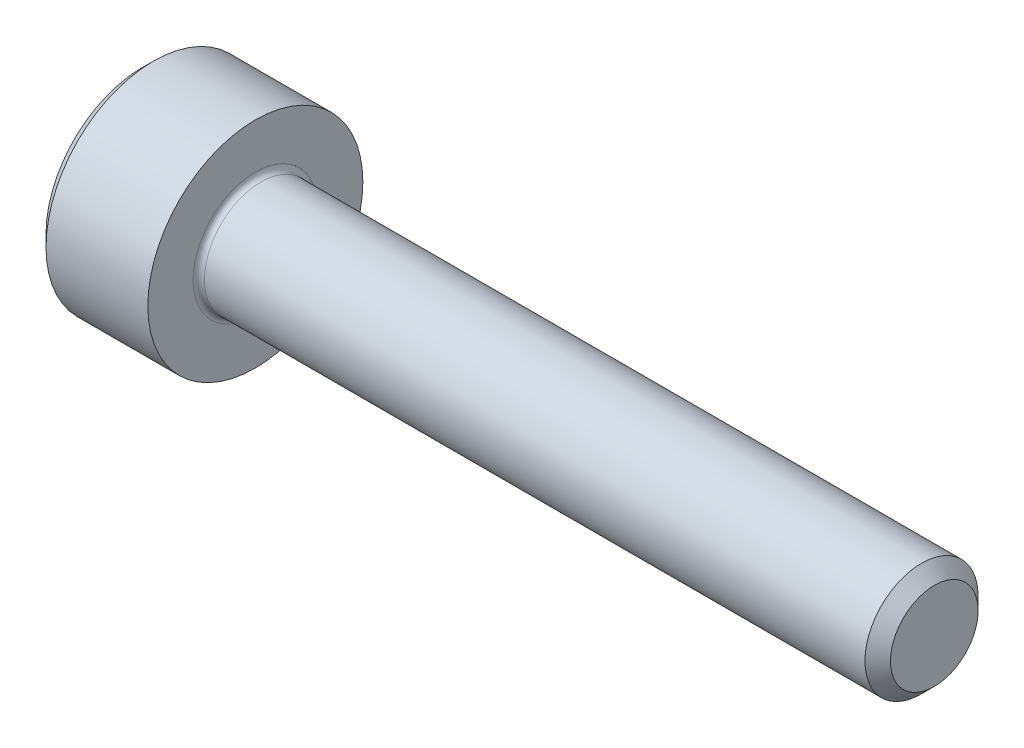
ISO-10303-21;
HEADER;
FILE_DESCRIPTION(('STEP AP214'),'2;1');
FILE_NAME('part.step','',(''),(''),'','','');
FILE_SCHEMA(('AUTOMOTIVE_DESIGN { 1 0 10303 214 1 1 1 1 }'));
ENDSEC;
DATA;
#1=APPLICATION_CONTEXT('core data for automotive mechanical design processes');
#2=APPLICATION_PROTOCOL_DEFINITION('international standard','automotive_design',2000,#1);
#3=PRODUCT_CONTEXT('',#1,'mechanical');
#4=PRODUCT('Part','Part','',(#3));
#5=PRODUCT_RELATED_PRODUCT_CATEGORY('part','',(#4));
#6=PRODUCT_DEFINITION_FORMATION('','',#4);
#7=PRODUCT_DEFINITION_CONTEXT('part definition',#1,'design');
#8=PRODUCT_DEFINITION('design','',#6,#7);
#9=PRODUCT_DEFINITION_SHAPE('','',#8);
#10=(LENGTH_UNIT() NAMED_UNIT(*) SI_UNIT(.MILLI.,.METRE.));
#11=(NAMED_UNIT(*) PLANE_ANGLE_UNIT() SI_UNIT($,.RADIAN.));
#12=(NAMED_UNIT(*) SI_UNIT($,.STERADIAN.) SOLID_ANGLE_UNIT());
#13=UNCERTAINTY_MEASURE_WITH_UNIT(LENGTH_MEASURE(1.E-05),#10,'distance_accuracy_value','');
#14=(GEOMETRIC_REPRESENTATION_CONTEXT(3) GLOBAL_UNCERTAINTY_ASSIGNED_CONTEXT((#13)) GLOBAL_UNIT_ASSIGNED_CONTEXT((#10,
#11,#12)) REPRESENTATION_CONTEXT('',''));
#15=CARTESIAN_POINT('',(0.,0.,0.));
#16=DIRECTION('',(0.,0.,1.));
#17=DIRECTION('',(1.,0.,0.));
#18=AXIS2_PLACEMENT_3D('',#15,#16,#17);
#19=CARTESIAN_POINT('',(0.,0.,0.));
#20=DIRECTION('',(-1.,0.,0.));
#21=DIRECTION('',(0.,0.,1.));
#22=AXIS2_PLACEMENT_3D('',#19,#20,#21);
#23=PLANE('',#22);
#24=DIRECTION('',(0.,-0.499999999999999,0.866025403784439));
#25=VECTOR('',#24,1.);
#26=CARTESIAN_POINT('',(0.,0.892006165897969,0.));
#27=LINE('',#26,#25);
#28=CARTESIAN_POINT('',(0.,0.892006165897969,0.));
#29=VERTEX_POINT('',#28);
#30=CARTESIAN_POINT('',(0.,0.446003082948984,0.772499999999997));
#31=VERTEX_POINT('',#30);
#32=EDGE_CURVE('E260',#29,#31,#27,.T.);
#33=ORIENTED_EDGE('',*,*,#32,.T.);
#34=DIRECTION('',(0.,1.,0.));
#35=VECTOR('',#34,1.);
#36=CARTESIAN_POINT('',(0.,-0.446003082948988,0.772499999999998));
#37=LINE('',#36,#35);
#38=CARTESIAN_POINT('',(0.,-0.446003082948988,0.772499999999998));
#39=VERTEX_POINT('',#38);
#40=EDGE_CURVE('E131',#39,#31,#37,.T.);
#41=ORIENTED_EDGE('',*,*,#40,.F.);
#42=DIRECTION('',(0.,-0.500000000000001,-0.866025403784438));
#43=VECTOR('',#42,1.);
#44=CARTESIAN_POINT('',(0.,-0.446003082948988,0.772499999999998));
#45=LINE('',#44,#43);
#46=CARTESIAN_POINT('',(0.,-0.892006165897975,0.));
#47=VERTEX_POINT('',#46);
#48=EDGE_CURVE('E263',#39,#47,#45,.T.);
#49=ORIENTED_EDGE('',*,*,#48,.T.);
#50=DIRECTION('',(0.,0.499999999999999,-0.866025403784439));
#51=VECTOR('',#50,1.);
#52=CARTESIAN_POINT('',(0.,-0.892006165897975,0.));
#53=LINE('',#52,#51);
#54=CARTESIAN_POINT('',(0.,-0.44600308294899,-0.772500000000002));
#55=VERTEX_POINT('',#54);
#56=EDGE_CURVE('E266',#47,#55,#53,.T.);
#57=ORIENTED_EDGE('',*,*,#56,.T.);
#58=DIRECTION('',(0.,-1.,0.));
#59=VECTOR('',#58,1.);
#60=CARTESIAN_POINT('',(0.,0.446003082948982,-0.772500000000003));
#61=LINE('',#60,#59);
#62=CARTESIAN_POINT('',(0.,0.446003082948982,-0.772500000000003));
#63=VERTEX_POINT('',#62);
#64=EDGE_CURVE('E269',#63,#55,#61,.T.);
#65=ORIENTED_EDGE('',*,*,#64,.F.);
#66=DIRECTION('',(0.,-0.500000000000001,-0.866025403784438));
#67=VECTOR('',#66,1.);
#68=CARTESIAN_POINT('',(0.,0.892006165897969,0.));
#69=LINE('',#68,#67);
#70=EDGE_CURVE('E126',#29,#63,#69,.T.);
#71=ORIENTED_EDGE('',*,*,#70,.F.);
#72=EDGE_LOOP('',(#33,#41,#49,#57,#65,#71));
#73=FACE_BOUND('',#72,.T.);
#74=CARTESIAN_POINT('',(0.,0.,0.));
#75=DIRECTION('',(-1.,0.,0.));
#76=DIRECTION('',(0.,0.,1.));
#77=AXIS2_PLACEMENT_3D('',#74,#75,#76);
#78=CIRCLE('',#77,1.7);
#79=CARTESIAN_POINT('',(0.,0.,1.7));
#80=VERTEX_POINT('',#79);
#81=EDGE_CURVE('E155',#80,#80,#78,.T.);
#82=ORIENTED_EDGE('',*,*,#81,.T.);
#83=EDGE_LOOP('',(#82));
#84=FACE_BOUND('',#83,.T.);
#85=ADVANCED_FACE('F35',(#73,#84),#23,.T.);
#86=CARTESIAN_POINT('',(0.,0.,0.));
#87=DIRECTION('',(1.,0.,0.));
#88=DIRECTION('',(0.,0.,-1.));
#89=AXIS2_PLACEMENT_3D('',#86,#87,#88);
#90=CONICAL_SURFACE('',#89,1.7,0.785398163397449);
#91=CARTESIAN_POINT('',(0.199999999999999,0.,0.));
#92=DIRECTION('',(-1.,0.,0.));
#93=DIRECTION('',(0.,0.,1.));
#94=AXIS2_PLACEMENT_3D('',#91,#92,#93);
#95=CIRCLE('',#94,1.9);
#96=CARTESIAN_POINT('',(0.199999999999999,0.,1.9));
#97=VERTEX_POINT('',#96);
#98=EDGE_CURVE('E152',#97,#97,#95,.T.);
#99=ORIENTED_EDGE('',*,*,#98,.T.);
#100=EDGE_LOOP('',(#99));
#101=FACE_BOUND('',#100,.T.);
#102=ORIENTED_EDGE('',*,*,#81,.F.);
#103=EDGE_LOOP('',(#102));
#104=FACE_BOUND('',#103,.T.);
#105=ADVANCED_FACE('F176',(#101,#104),#90,.T.);
#106=CARTESIAN_POINT('',(-31.75,0.,0.));
#107=DIRECTION('',(-1.,0.,0.));
#108=DIRECTION('',(0.,0.,1.));
#109=AXIS2_PLACEMENT_3D('',#106,#107,#108);
#110=CYLINDRICAL_SURFACE('',#109,1.9);
#111=CARTESIAN_POINT('',(2.,0.,0.));
#112=DIRECTION('',(-1.,0.,0.));
#113=DIRECTION('',(0.,0.,1.));
#114=AXIS2_PLACEMENT_3D('',#111,#112,#113);
#115=CIRCLE('',#114,1.9);
#116=CARTESIAN_POINT('',(2.,0.,1.9));
#117=VERTEX_POINT('',#116);
#118=EDGE_CURVE('E149',#117,#117,#115,.T.);
#119=ORIENTED_EDGE('',*,*,#118,.T.);
#120=EDGE_LOOP('',(#119));
#121=FACE_BOUND('',#120,.T.);
#122=ORIENTED_EDGE('',*,*,#98,.F.);
#123=EDGE_LOOP('',(#122));
#124=FACE_BOUND('',#123,.T.);
#125=ADVANCED_FACE('F181',(#121,#124),#110,.T.);
#126=CARTESIAN_POINT('',(2.,1.9,0.));
#127=DIRECTION('',(1.,0.,0.));
#128=DIRECTION('',(0.,0.,-1.));
#129=AXIS2_PLACEMENT_3D('',#126,#127,#128);
#130=PLANE('',#129);
#131=CARTESIAN_POINT('',(2.,0.,0.));
#132=DIRECTION('',(1.,0.,0.));
#133=DIRECTION('',(0.,0.,-1.));
#134=AXIS2_PLACEMENT_3D('',#131,#132,#133);
#135=CIRCLE('',#134,1.09999999999999);
#136=CARTESIAN_POINT('',(2.,0.,-1.09999999999999));
#137=VERTEX_POINT('',#136);
#138=EDGE_CURVE('E43',#137,#137,#135,.F.);
#139=ORIENTED_EDGE('',*,*,#138,.T.);
#140=EDGE_LOOP('',(#139));
#141=FACE_BOUND('',#140,.T.);
#142=ORIENTED_EDGE('',*,*,#118,.F.);
#143=EDGE_LOOP('',(#142));
#144=FACE_BOUND('',#143,.T.);
#145=ADVANCED_FACE('F160',(#141,#144),#130,.T.);
#146=CARTESIAN_POINT('',(-31.75,0.,0.));
#147=DIRECTION('',(-1.,0.,0.));
#148=DIRECTION('',(0.,0.,1.));
#149=AXIS2_PLACEMENT_3D('',#146,#147,#148);
#150=CYLINDRICAL_SURFACE('',#149,0.999999999999993);
#151=CARTESIAN_POINT('',(2.1,0.,0.));
#152=DIRECTION('',(1.,0.,0.));
#153=DIRECTION('',(0.,0.,-1.));
#154=AXIS2_PLACEMENT_3D('',#151,#152,#153);
#155=CIRCLE('',#154,0.999999999999993);
#156=CARTESIAN_POINT('',(2.1,0.,-0.999999999999993));
#157=VERTEX_POINT('',#156);
#158=EDGE_CURVE('E11',#157,#157,#155,.T.);
#159=ORIENTED_EDGE('',*,*,#158,.T.);
#160=EDGE_LOOP('',(#159));
#161=FACE_BOUND('',#160,.T.);
#162=CARTESIAN_POINT('',(13.774,0.,0.));
#163=DIRECTION('',(-1.,0.,0.));
#164=DIRECTION('',(0.,0.,1.));
#165=AXIS2_PLACEMENT_3D('',#162,#163,#164);
#166=CIRCLE('',#165,0.999999999999985);
#167=CARTESIAN_POINT('',(13.774,0.,0.999999999999985));
#168=VERTEX_POINT('',#167);
#169=EDGE_CURVE('E146',#168,#168,#166,.T.);
#170=ORIENTED_EDGE('',*,*,#169,.T.);
#171=EDGE_LOOP('',(#170));
#172=FACE_BOUND('',#171,.T.);
#173=ADVANCED_FACE('F191',(#161,#172),#150,.T.);
#174=CARTESIAN_POINT('',(14.,0.,0.));
#175=DIRECTION('',(-1.,0.,0.));
#176=DIRECTION('',(0.,0.,1.));
#177=AXIS2_PLACEMENT_3D('',#174,#175,#176);
#178=CONICAL_SURFACE('',#177,0.774,0.785398163397406);
#179=ORIENTED_EDGE('',*,*,#169,.F.);
#180=EDGE_LOOP('',(#179));
#181=FACE_BOUND('',#180,.T.);
#182=CARTESIAN_POINT('',(14.,0.,0.));
#183=DIRECTION('',(-1.,0.,0.));
#184=DIRECTION('',(0.,0.,1.));
#185=AXIS2_PLACEMENT_3D('',#182,#183,#184);
#186=CIRCLE('',#185,0.774);
#187=CARTESIAN_POINT('',(14.,0.,0.774));
#188=VERTEX_POINT('',#187);
#189=EDGE_CURVE('E142',#188,#188,#186,.T.);
#190=ORIENTED_EDGE('',*,*,#189,.T.);
#191=EDGE_LOOP('',(#190));
#192=FACE_BOUND('',#191,.T.);
#193=ADVANCED_FACE('F171',(#181,#192),#178,.T.);
#194=CARTESIAN_POINT('',(14.,0.774,0.));
#195=DIRECTION('',(1.,0.,0.));
#196=DIRECTION('',(0.,0.,-1.));
#197=AXIS2_PLACEMENT_3D('',#194,#195,#196);
#198=PLANE('',#197);
#199=ORIENTED_EDGE('',*,*,#189,.F.);
#200=EDGE_LOOP('',(#199));
#201=FACE_BOUND('',#200,.T.);
#202=ADVANCED_FACE('F164',(#201),#198,.T.);
#203=CARTESIAN_POINT('',(2.1,0.,0.));
#204=DIRECTION('',(1.,0.,0.));
#205=DIRECTION('',(0.,0.,-1.));
#206=AXIS2_PLACEMENT_3D('',#203,#204,#205);
#207=TOROIDAL_SURFACE('',#206,1.09999999999999,0.1);
#208=ORIENTED_EDGE('',*,*,#158,.F.);
#209=EDGE_LOOP('',(#208));
#210=FACE_BOUND('',#209,.T.);
#211=ORIENTED_EDGE('',*,*,#138,.F.);
#212=EDGE_LOOP('',(#211));
#213=FACE_BOUND('',#212,.T.);
#214=ADVANCED_FACE('F37',(#210,#213),#207,.F.);
#215=CARTESIAN_POINT('',(1.,0.892006165897969,0.));
#216=DIRECTION('',(0.,-0.866025403784439,-0.499999999999999));
#217=DIRECTION('',(0.,0.499999999999999,-0.866025403784439));
#218=AXIS2_PLACEMENT_3D('',#215,#216,#217);
#219=PLANE('',#218);
#220=ORIENTED_EDGE('',*,*,#32,.F.);
#221=DIRECTION('',(-1.,0.,0.));
#222=VECTOR('',#221,1.);
#223=CARTESIAN_POINT('',(1.,0.892006165897969,0.));
#224=LINE('',#223,#222);
#225=CARTESIAN_POINT('',(1.,0.892006165897969,0.));
#226=VERTEX_POINT('',#225);
#227=EDGE_CURVE('E250',#226,#29,#224,.T.);
#228=ORIENTED_EDGE('',*,*,#227,.F.);
#229=DIRECTION('',(0.,-0.499999999999999,0.866025403784439));
#230=VECTOR('',#229,1.);
#231=CARTESIAN_POINT('',(1.,0.892006165897969,0.));
#232=LINE('',#231,#230);
#233=CARTESIAN_POINT('',(1.,0.669004624423476,0.386249999999997));
#234=VERTEX_POINT('',#233);
#235=EDGE_CURVE('E118',#226,#234,#232,.T.);
#236=ORIENTED_EDGE('',*,*,#235,.T.);
#237=CARTESIAN_POINT('',(1.,0.446003082948984,0.772499999999997));
#238=VERTEX_POINT('',#237);
#239=EDGE_CURVE('E109',#234,#238,#232,.T.);
#240=ORIENTED_EDGE('',*,*,#239,.T.);
#241=DIRECTION('',(-1.,0.,0.));
#242=VECTOR('',#241,1.);
#243=CARTESIAN_POINT('',(1.,0.446003082948984,0.772499999999997));
#244=LINE('',#243,#242);
#245=EDGE_CURVE('E123',#238,#31,#244,.T.);
#246=ORIENTED_EDGE('',*,*,#245,.T.);
#247=EDGE_LOOP('',(#220,#228,#236,#240,#246));
#248=FACE_BOUND('',#247,.T.);
#249=ADVANCED_FACE('F122',(#248),#219,.T.);
#250=CARTESIAN_POINT('',(1.,-0.446003082948988,0.772499999999998));
#251=DIRECTION('',(0.,0.,1.));
#252=DIRECTION('',(0.,-1.,0.));
#253=AXIS2_PLACEMENT_3D('',#250,#251,#252);
#254=PLANE('',#253);
#255=ORIENTED_EDGE('',*,*,#40,.T.);
#256=ORIENTED_EDGE('',*,*,#245,.F.);
#257=DIRECTION('',(0.,1.,0.));
#258=VECTOR('',#257,1.);
#259=CARTESIAN_POINT('',(1.,-0.446003082948988,0.772499999999998));
#260=LINE('',#259,#258);
#261=CARTESIAN_POINT('',(1.,0.,0.772499999999998));
#262=VERTEX_POINT('',#261);
#263=EDGE_CURVE('E106',#262,#238,#260,.T.);
#264=ORIENTED_EDGE('',*,*,#263,.F.);
#265=CARTESIAN_POINT('',(1.,-0.446003082948988,0.772499999999998));
#266=VERTEX_POINT('',#265);
#267=EDGE_CURVE('E117',#266,#262,#260,.T.);
#268=ORIENTED_EDGE('',*,*,#267,.F.);
#269=DIRECTION('',(-1.,0.,0.));
#270=VECTOR('',#269,1.);
#271=CARTESIAN_POINT('',(1.,-0.446003082948988,0.772499999999998));
#272=LINE('',#271,#270);
#273=EDGE_CURVE('E133',#266,#39,#272,.T.);
#274=ORIENTED_EDGE('',*,*,#273,.T.);
#275=EDGE_LOOP('',(#255,#256,#264,#268,#274));
#276=FACE_BOUND('',#275,.T.);
#277=ADVANCED_FACE('F128',(#276),#254,.F.);
#278=CARTESIAN_POINT('',(1.,-0.446003082948988,0.772499999999998));
#279=DIRECTION('',(0.,0.866025403784438,-0.500000000000001));
#280=DIRECTION('',(0.,0.500000000000001,0.866025403784438));
#281=AXIS2_PLACEMENT_3D('',#278,#279,#280);
#282=PLANE('',#281);
#283=ORIENTED_EDGE('',*,*,#48,.F.);
#284=ORIENTED_EDGE('',*,*,#273,.F.);
#285=DIRECTION('',(0.,-0.500000000000001,-0.866025403784438));
#286=VECTOR('',#285,1.);
#287=CARTESIAN_POINT('',(1.,-0.446003082948988,0.772499999999998));
#288=LINE('',#287,#286);
#289=CARTESIAN_POINT('',(1.,-0.66900462442348,0.386250000000001));
#290=VERTEX_POINT('',#289);
#291=EDGE_CURVE('E289',#266,#290,#288,.T.);
#292=ORIENTED_EDGE('',*,*,#291,.T.);
#293=CARTESIAN_POINT('',(1.,-0.892006165897975,0.));
#294=VERTEX_POINT('',#293);
#295=EDGE_CURVE('E278',#290,#294,#288,.T.);
#296=ORIENTED_EDGE('',*,*,#295,.T.);
#297=DIRECTION('',(-1.,0.,0.));
#298=VECTOR('',#297,1.);
#299=CARTESIAN_POINT('',(1.,-0.892006165897975,0.));
#300=LINE('',#299,#298);
#301=EDGE_CURVE('E138',#294,#47,#300,.T.);
#302=ORIENTED_EDGE('',*,*,#301,.T.);
#303=EDGE_LOOP('',(#283,#284,#292,#296,#302));
#304=FACE_BOUND('',#303,.T.);
#305=ADVANCED_FACE('F204',(#304),#282,.T.);
#306=CARTESIAN_POINT('',(1.,-0.892006165897975,0.));
#307=DIRECTION('',(0.,0.866025403784439,0.499999999999999));
#308=DIRECTION('',(0.,-0.499999999999999,0.866025403784439));
#309=AXIS2_PLACEMENT_3D('',#306,#307,#308);
#310=PLANE('',#309);
#311=ORIENTED_EDGE('',*,*,#56,.F.);
#312=ORIENTED_EDGE('',*,*,#301,.F.);
#313=DIRECTION('',(0.,0.499999999999999,-0.866025403784439));
#314=VECTOR('',#313,1.);
#315=CARTESIAN_POINT('',(1.,-0.892006165897975,0.));
#316=LINE('',#315,#314);
#317=CARTESIAN_POINT('',(1.,-0.669004624423483,-0.386250000000001));
#318=VERTEX_POINT('',#317);
#319=EDGE_CURVE('E256',#294,#318,#316,.T.);
#320=ORIENTED_EDGE('',*,*,#319,.T.);
#321=CARTESIAN_POINT('',(1.,-0.44600308294899,-0.772500000000002));
#322=VERTEX_POINT('',#321);
#323=EDGE_CURVE('E288',#318,#322,#316,.T.);
#324=ORIENTED_EDGE('',*,*,#323,.T.);
#325=DIRECTION('',(-1.,0.,0.));
#326=VECTOR('',#325,1.);
#327=CARTESIAN_POINT('',(1.,-0.44600308294899,-0.772500000000002));
#328=LINE('',#327,#326);
#329=EDGE_CURVE('E249',#322,#55,#328,.T.);
#330=ORIENTED_EDGE('',*,*,#329,.T.);
#331=EDGE_LOOP('',(#311,#312,#320,#324,#330));
#332=FACE_BOUND('',#331,.T.);
#333=ADVANCED_FACE('F207',(#332),#310,.T.);
#334=CARTESIAN_POINT('',(1.,0.446003082948982,-0.772500000000003));
#335=DIRECTION('',(0.,0.,-1.));
#336=DIRECTION('',(0.,1.,0.));
#337=AXIS2_PLACEMENT_3D('',#334,#335,#336);
#338=PLANE('',#337);
#339=ORIENTED_EDGE('',*,*,#64,.T.);
#340=ORIENTED_EDGE('',*,*,#329,.F.);
#341=DIRECTION('',(0.,-1.,0.));
#342=VECTOR('',#341,1.);
#343=CARTESIAN_POINT('',(1.,0.446003082948982,-0.772500000000003));
#344=LINE('',#343,#342);
#345=CARTESIAN_POINT('',(1.,0.,-0.7725));
#346=VERTEX_POINT('',#345);
#347=EDGE_CURVE('E253',#346,#322,#344,.T.);
#348=ORIENTED_EDGE('',*,*,#347,.F.);
#349=CARTESIAN_POINT('',(1.,0.446003082948982,-0.772500000000003));
#350=VERTEX_POINT('',#349);
#351=EDGE_CURVE('E50',#350,#346,#344,.T.);
#352=ORIENTED_EDGE('',*,*,#351,.F.);
#353=DIRECTION('',(-1.,0.,0.));
#354=VECTOR('',#353,1.);
#355=CARTESIAN_POINT('',(1.,0.446003082948982,-0.772500000000003));
#356=LINE('',#355,#354);
#357=EDGE_CURVE('E246',#350,#63,#356,.T.);
#358=ORIENTED_EDGE('',*,*,#357,.T.);
#359=EDGE_LOOP('',(#339,#340,#348,#352,#358));
#360=FACE_BOUND('',#359,.T.);
#361=ADVANCED_FACE('F211',(#360),#338,.F.);
#362=CARTESIAN_POINT('',(1.,0.892006165897969,0.));
#363=DIRECTION('',(0.,0.866025403784438,-0.500000000000001));
#364=DIRECTION('',(0.,0.500000000000001,0.866025403784438));
#365=AXIS2_PLACEMENT_3D('',#362,#363,#364);
#366=PLANE('',#365);
#367=ORIENTED_EDGE('',*,*,#70,.T.);
#368=ORIENTED_EDGE('',*,*,#357,.F.);
#369=DIRECTION('',(0.,-0.500000000000001,-0.866025403784438));
#370=VECTOR('',#369,1.);
#371=CARTESIAN_POINT('',(1.,0.892006165897969,0.));
#372=LINE('',#371,#370);
#373=CARTESIAN_POINT('',(1.,0.669004624423477,-0.38625));
#374=VERTEX_POINT('',#373);
#375=EDGE_CURVE('E236',#374,#350,#372,.T.);
#376=ORIENTED_EDGE('',*,*,#375,.F.);
#377=EDGE_CURVE('E242',#226,#374,#372,.T.);
#378=ORIENTED_EDGE('',*,*,#377,.F.);
#379=ORIENTED_EDGE('',*,*,#227,.T.);
#380=EDGE_LOOP('',(#367,#368,#376,#378,#379));
#381=FACE_BOUND('',#380,.T.);
#382=ADVANCED_FACE('F215',(#381),#366,.F.);
#383=CARTESIAN_POINT('',(1.,1.33800924884695,-0.772500000000004));
#384=DIRECTION('',(1.,0.,0.));
#385=DIRECTION('',(0.,0.,-1.));
#386=AXIS2_PLACEMENT_3D('',#383,#384,#385);
#387=PLANE('',#386);
#388=ORIENTED_EDGE('',*,*,#347,.T.);
#389=ORIENTED_EDGE('',*,*,#323,.F.);
#390=CARTESIAN_POINT('',(1.,0.,0.));
#391=DIRECTION('',(-1.,0.,0.));
#392=DIRECTION('',(0.,0.,1.));
#393=AXIS2_PLACEMENT_3D('',#390,#391,#392);
#394=CIRCLE('',#393,0.7725);
#395=EDGE_CURVE('E284',#346,#318,#394,.T.);
#396=ORIENTED_EDGE('',*,*,#395,.F.);
#397=EDGE_LOOP('',(#388,#389,#396));
#398=FACE_BOUND('',#397,.T.);
#399=ADVANCED_FACE('F219',(#398),#387,.F.);
#400=ORIENTED_EDGE('',*,*,#319,.F.);
#401=ORIENTED_EDGE('',*,*,#295,.F.);
#402=EDGE_CURVE('E136',#318,#290,#394,.T.);
#403=ORIENTED_EDGE('',*,*,#402,.F.);
#404=EDGE_LOOP('',(#400,#401,#403));
#405=FACE_BOUND('',#404,.T.);
#406=ADVANCED_FACE('F222',(#405),#387,.F.);
#407=ORIENTED_EDGE('',*,*,#291,.F.);
#408=ORIENTED_EDGE('',*,*,#267,.T.);
#409=EDGE_CURVE('E132',#290,#262,#394,.T.);
#410=ORIENTED_EDGE('',*,*,#409,.F.);
#411=EDGE_LOOP('',(#407,#408,#410));
#412=FACE_BOUND('',#411,.T.);
#413=ADVANCED_FACE('F227',(#412),#387,.F.);
#414=ORIENTED_EDGE('',*,*,#263,.T.);
#415=ORIENTED_EDGE('',*,*,#239,.F.);
#416=EDGE_CURVE('E112',#262,#234,#394,.T.);
#417=ORIENTED_EDGE('',*,*,#416,.F.);
#418=EDGE_LOOP('',(#414,#415,#417));
#419=FACE_BOUND('',#418,.T.);
#420=ADVANCED_FACE('F108',(#419),#387,.F.);
#421=ORIENTED_EDGE('',*,*,#235,.F.);
#422=ORIENTED_EDGE('',*,*,#377,.T.);
#423=EDGE_CURVE('E143',#234,#374,#394,.T.);
#424=ORIENTED_EDGE('',*,*,#423,.F.);
#425=EDGE_LOOP('',(#421,#422,#424));
#426=FACE_BOUND('',#425,.T.);
#427=ADVANCED_FACE('F230',(#426),#387,.F.);
#428=ORIENTED_EDGE('',*,*,#375,.T.);
#429=ORIENTED_EDGE('',*,*,#351,.T.);
#430=EDGE_CURVE('E239',#374,#346,#394,.T.);
#431=ORIENTED_EDGE('',*,*,#430,.F.);
#432=EDGE_LOOP('',(#428,#429,#431));
#433=FACE_BOUND('',#432,.T.);
#434=ADVANCED_FACE('F200',(#433),#387,.F.);
#435=CARTESIAN_POINT('',(1.,0.,0.));
#436=DIRECTION('',(-1.,0.,0.));
#437=DIRECTION('',(0.,0.,1.));
#438=AXIS2_PLACEMENT_3D('',#435,#436,#437);
#439=CONICAL_SURFACE('',#438,0.7725,1.04719755119659);
#440=CARTESIAN_POINT('',(1.446003082949,0.,0.));
#441=VERTEX_POINT('',#440);
#442=VERTEX_LOOP('',#441);
#443=FACE_BOUND('',#442,.T.);
#444=ORIENTED_EDGE('',*,*,#416,.T.);
#445=ORIENTED_EDGE('',*,*,#423,.T.);
#446=ORIENTED_EDGE('',*,*,#430,.T.);
#447=ORIENTED_EDGE('',*,*,#395,.T.);
#448=ORIENTED_EDGE('',*,*,#402,.T.);
#449=ORIENTED_EDGE('',*,*,#409,.T.);
#450=EDGE_LOOP('',(#444,#445,#446,#447,#448,#449));
#451=FACE_BOUND('',#450,.T.);
#452=ADVANCED_FACE('F198',(#443,#451),#439,.F.);
#453=CLOSED_SHELL('',(#85,#105,#125,#145,#173,#193,#202,#214,#249,#277,#305,#333,#361,#382,#399,
#406,#413,#420,#427,#434,#452));
#454=MANIFOLD_SOLID_BREP('B2',#453);
#455=ADVANCED_BREP_SHAPE_REPRESENTATION('',(#18,#454),#14);
#456=SHAPE_DEFINITION_REPRESENTATION(#9,#455);
ENDSEC;
END-ISO-10303-21;
